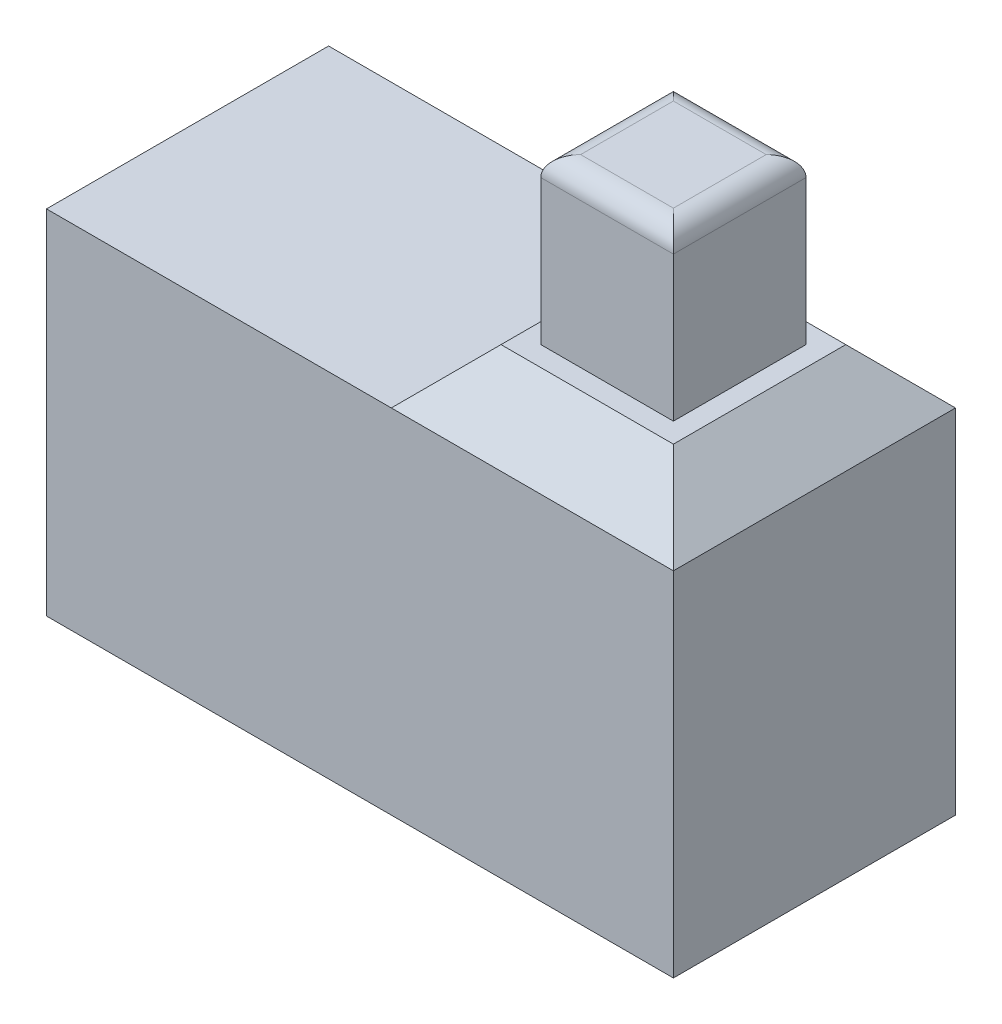
ISO-10303-21;
HEADER;
FILE_DESCRIPTION(('STEP AP214'),'2;1');
FILE_NAME('part.step','',(''),(''),'','','');
FILE_SCHEMA(('AUTOMOTIVE_DESIGN { 1 0 10303 214 1 1 1 1 }'));
ENDSEC;
DATA;
#1=APPLICATION_CONTEXT('core data for automotive mechanical design processes');
#2=APPLICATION_PROTOCOL_DEFINITION('international standard','automotive_design',2000,#1);
#3=PRODUCT_CONTEXT('',#1,'mechanical');
#4=PRODUCT('Part','Part','',(#3));
#5=PRODUCT_RELATED_PRODUCT_CATEGORY('part','',(#4));
#6=PRODUCT_DEFINITION_FORMATION('','',#4);
#7=PRODUCT_DEFINITION_CONTEXT('part definition',#1,'design');
#8=PRODUCT_DEFINITION('design','',#6,#7);
#9=PRODUCT_DEFINITION_SHAPE('','',#8);
#10=(LENGTH_UNIT() NAMED_UNIT(*) SI_UNIT(.MILLI.,.METRE.));
#11=(NAMED_UNIT(*) PLANE_ANGLE_UNIT() SI_UNIT($,.RADIAN.));
#12=(NAMED_UNIT(*) SI_UNIT($,.STERADIAN.) SOLID_ANGLE_UNIT());
#13=UNCERTAINTY_MEASURE_WITH_UNIT(LENGTH_MEASURE(1.E-05),#10,'distance_accuracy_value','');
#14=(GEOMETRIC_REPRESENTATION_CONTEXT(3) GLOBAL_UNCERTAINTY_ASSIGNED_CONTEXT((#13)) GLOBAL_UNIT_ASSIGNED_CONTEXT((#10,
#11,#12)) REPRESENTATION_CONTEXT('',''));
#15=CARTESIAN_POINT('',(0.,0.,0.));
#16=DIRECTION('',(0.,0.,1.));
#17=DIRECTION('',(1.,0.,0.));
#18=AXIS2_PLACEMENT_3D('',#15,#16,#17);
#19=CARTESIAN_POINT('',(0.,5.19999999999998,0.));
#20=DIRECTION('',(0.,-1.,0.));
#21=DIRECTION('',(0.,0.,-1.));
#22=AXIS2_PLACEMENT_3D('',#19,#20,#21);
#23=PLANE('',#22);
#24=DIRECTION('',(0.,0.,1.));
#25=VECTOR('',#24,1.);
#26=CARTESIAN_POINT('',(3.29999999999997,5.19999999999998,-1.11022302462516E-13));
#27=LINE('',#26,#25);
#28=CARTESIAN_POINT('',(3.3,5.19999999999998,1.09999999999999));
#29=VERTEX_POINT('',#28);
#30=CARTESIAN_POINT('',(3.3,5.19999999999998,-1.10000000000002));
#31=VERTEX_POINT('',#30);
#32=EDGE_CURVE('E179',#29,#31,#27,.F.);
#33=ORIENTED_EDGE('',*,*,#32,.T.);
#34=DIRECTION('',(1.,0.,0.));
#35=VECTOR('',#34,1.);
#36=CARTESIAN_POINT('',(0.,5.19999999999998,-1.10000000000002));
#37=LINE('',#36,#35);
#38=CARTESIAN_POINT('',(1.09999999999999,5.19999999999998,-1.09999999999999));
#39=VERTEX_POINT('',#38);
#40=EDGE_CURVE('E413',#31,#39,#37,.F.);
#41=ORIENTED_EDGE('',*,*,#40,.T.);
#42=DIRECTION('',(0.,0.,-1.));
#43=VECTOR('',#42,1.);
#44=CARTESIAN_POINT('',(1.09999999999999,5.19999999999998,0.));
#45=LINE('',#44,#43);
#46=CARTESIAN_POINT('',(1.09999999999999,5.19999999999998,1.09999999999999));
#47=VERTEX_POINT('',#46);
#48=EDGE_CURVE('E419',#39,#47,#45,.F.);
#49=ORIENTED_EDGE('',*,*,#48,.T.);
#50=DIRECTION('',(-1.,0.,0.));
#51=VECTOR('',#50,1.);
#52=CARTESIAN_POINT('',(0.,5.19999999999998,1.09999999999999));
#53=LINE('',#52,#51);
#54=EDGE_CURVE('E418',#47,#29,#53,.F.);
#55=ORIENTED_EDGE('',*,*,#54,.T.);
#56=EDGE_LOOP('',(#33,#41,#49,#55));
#57=FACE_BOUND('',#56,.T.);
#58=DIRECTION('',(1.,0.,0.));
#59=VECTOR('',#58,1.);
#60=CARTESIAN_POINT('',(1.35399999999999,5.19999999999998,0.845999999999986));
#61=LINE('',#60,#59);
#62=CARTESIAN_POINT('',(1.35399999999999,5.19999999999998,0.845999999999986));
#63=VERTEX_POINT('',#62);
#64=CARTESIAN_POINT('',(3.04599999999999,5.19999999999998,0.845999999999902));
#65=VERTEX_POINT('',#64);
#66=EDGE_CURVE('E130',#63,#65,#61,.T.);
#67=ORIENTED_EDGE('',*,*,#66,.F.);
#68=DIRECTION('',(0.,0.,1.));
#69=VECTOR('',#68,1.);
#70=CARTESIAN_POINT('',(1.35399999999999,5.19999999999998,-0.845999999999986));
#71=LINE('',#70,#69);
#72=CARTESIAN_POINT('',(1.35399999999999,5.19999999999998,-0.845999999999986));
#73=VERTEX_POINT('',#72);
#74=EDGE_CURVE('E135',#73,#63,#71,.T.);
#75=ORIENTED_EDGE('',*,*,#74,.F.);
#76=DIRECTION('',(-1.,0.,0.));
#77=VECTOR('',#76,1.);
#78=CARTESIAN_POINT('',(3.04599999999999,5.19999999999998,-0.845999999999986));
#79=LINE('',#78,#77);
#80=CARTESIAN_POINT('',(3.04599999999999,5.19999999999998,-0.845999999999986));
#81=VERTEX_POINT('',#80);
#82=EDGE_CURVE('E147',#81,#73,#79,.T.);
#83=ORIENTED_EDGE('',*,*,#82,.F.);
#84=DIRECTION('',(0.,0.,-1.));
#85=VECTOR('',#84,1.);
#86=CARTESIAN_POINT('',(3.04599999999999,5.19999999999998,0.845999999999902));
#87=LINE('',#86,#85);
#88=EDGE_CURVE('E143',#65,#81,#87,.T.);
#89=ORIENTED_EDGE('',*,*,#88,.F.);
#90=EDGE_LOOP('',(#67,#75,#83,#89));
#91=FACE_BOUND('',#90,.T.);
#92=ADVANCED_FACE('F34',(#57,#91),#23,.F.);
#93=CARTESIAN_POINT('',(-3.99999999999992,4.5,1.80000000000002));
#94=DIRECTION('',(1.,0.,0.));
#95=DIRECTION('',(0.,0.,-1.));
#96=AXIS2_PLACEMENT_3D('',#93,#94,#95);
#97=PLANE('',#96);
#98=DIRECTION('',(0.,0.,1.));
#99=VECTOR('',#98,1.);
#100=CARTESIAN_POINT('',(-3.99999999999992,0.,1.80000000000002));
#101=LINE('',#100,#99);
#102=CARTESIAN_POINT('',(-4.,0.,-1.8));
#103=VERTEX_POINT('',#102);
#104=CARTESIAN_POINT('',(-3.99999999999992,0.,1.80000000000002));
#105=VERTEX_POINT('',#104);
#106=EDGE_CURVE('E380',#103,#105,#101,.T.);
#107=ORIENTED_EDGE('',*,*,#106,.T.);
#108=DIRECTION('',(0.,-1.,0.));
#109=VECTOR('',#108,1.);
#110=CARTESIAN_POINT('',(-3.99999999999992,4.5,1.80000000000002));
#111=LINE('',#110,#109);
#112=CARTESIAN_POINT('',(-3.99999999999992,4.5,1.80000000000002));
#113=VERTEX_POINT('',#112);
#114=EDGE_CURVE('E189',#113,#105,#111,.T.);
#115=ORIENTED_EDGE('',*,*,#114,.F.);
#116=DIRECTION('',(0.,0.,1.));
#117=VECTOR('',#116,1.);
#118=CARTESIAN_POINT('',(-3.99999999999992,4.5,1.80000000000002));
#119=LINE('',#118,#117);
#120=CARTESIAN_POINT('',(-4.,4.5,-1.8));
#121=VERTEX_POINT('',#120);
#122=EDGE_CURVE('E390',#121,#113,#119,.T.);
#123=ORIENTED_EDGE('',*,*,#122,.F.);
#124=DIRECTION('',(0.,-1.,0.));
#125=VECTOR('',#124,1.);
#126=CARTESIAN_POINT('',(-4.,4.5,-1.8));
#127=LINE('',#126,#125);
#128=EDGE_CURVE('E394',#121,#103,#127,.T.);
#129=ORIENTED_EDGE('',*,*,#128,.T.);
#130=EDGE_LOOP('',(#107,#115,#123,#129));
#131=FACE_BOUND('',#130,.T.);
#132=ADVANCED_FACE('F236',(#131),#97,.F.);
#133=CARTESIAN_POINT('',(4.,4.5,1.8));
#134=DIRECTION('',(0.,0.,-1.));
#135=DIRECTION('',(-1.,0.,0.));
#136=AXIS2_PLACEMENT_3D('',#133,#134,#135);
#137=PLANE('',#136);
#138=DIRECTION('',(1.,0.,0.));
#139=VECTOR('',#138,1.);
#140=CARTESIAN_POINT('',(4.,0.,1.8));
#141=LINE('',#140,#139);
#142=CARTESIAN_POINT('',(4.,0.,1.8));
#143=VERTEX_POINT('',#142);
#144=EDGE_CURVE('E370',#105,#143,#141,.T.);
#145=ORIENTED_EDGE('',*,*,#144,.T.);
#146=DIRECTION('',(0.,-1.,0.));
#147=VECTOR('',#146,1.);
#148=CARTESIAN_POINT('',(4.,4.5,1.8));
#149=LINE('',#148,#147);
#150=CARTESIAN_POINT('',(4.,4.5,1.8));
#151=VERTEX_POINT('',#150);
#152=EDGE_CURVE('E373',#151,#143,#149,.T.);
#153=ORIENTED_EDGE('',*,*,#152,.F.);
#154=DIRECTION('',(1.,0.,0.));
#155=VECTOR('',#154,1.);
#156=CARTESIAN_POINT('',(4.,4.5,1.8));
#157=LINE('',#156,#155);
#158=CARTESIAN_POINT('',(0.400000000000095,4.5,1.8));
#159=VERTEX_POINT('',#158);
#160=EDGE_CURVE('E166',#159,#151,#157,.T.);
#161=ORIENTED_EDGE('',*,*,#160,.F.);
#162=DIRECTION('',(1.,0.,0.));
#163=VECTOR('',#162,1.);
#164=CARTESIAN_POINT('',(4.,4.5,1.8));
#165=LINE('',#164,#163);
#166=EDGE_CURVE('E399',#113,#159,#165,.T.);
#167=ORIENTED_EDGE('',*,*,#166,.F.);
#168=ORIENTED_EDGE('',*,*,#114,.T.);
#169=EDGE_LOOP('',(#145,#153,#161,#167,#168));
#170=FACE_BOUND('',#169,.T.);
#171=ADVANCED_FACE('F242',(#170),#137,.F.);
#172=CARTESIAN_POINT('',(4.,4.5,1.8));
#173=DIRECTION('',(-1.,0.,0.));
#174=DIRECTION('',(0.,0.,1.));
#175=AXIS2_PLACEMENT_3D('',#172,#173,#174);
#176=PLANE('',#175);
#177=DIRECTION('',(0.,0.,-1.));
#178=VECTOR('',#177,1.);
#179=CARTESIAN_POINT('',(4.,0.,1.8));
#180=LINE('',#179,#178);
#181=CARTESIAN_POINT('',(3.99999999999989,0.,-1.8));
#182=VERTEX_POINT('',#181);
#183=EDGE_CURVE('E379',#143,#182,#180,.T.);
#184=ORIENTED_EDGE('',*,*,#183,.T.);
#185=DIRECTION('',(0.,-1.,0.));
#186=VECTOR('',#185,1.);
#187=CARTESIAN_POINT('',(3.99999999999989,4.5,-1.8));
#188=LINE('',#187,#186);
#189=CARTESIAN_POINT('',(3.99999999999989,4.5,-1.8));
#190=VERTEX_POINT('',#189);
#191=EDGE_CURVE('E385',#190,#182,#188,.T.);
#192=ORIENTED_EDGE('',*,*,#191,.F.);
#193=DIRECTION('',(0.,0.,-1.));
#194=VECTOR('',#193,1.);
#195=CARTESIAN_POINT('',(4.,4.5,1.8));
#196=LINE('',#195,#194);
#197=EDGE_CURVE('E384',#151,#190,#196,.T.);
#198=ORIENTED_EDGE('',*,*,#197,.F.);
#199=ORIENTED_EDGE('',*,*,#152,.T.);
#200=EDGE_LOOP('',(#184,#192,#198,#199));
#201=FACE_BOUND('',#200,.T.);
#202=ADVANCED_FACE('F276',(#201),#176,.F.);
#203=CARTESIAN_POINT('',(3.99999999999989,4.5,-1.8));
#204=DIRECTION('',(0.,0.,1.));
#205=DIRECTION('',(1.,0.,0.));
#206=AXIS2_PLACEMENT_3D('',#203,#204,#205);
#207=PLANE('',#206);
#208=DIRECTION('',(-1.,0.,0.));
#209=VECTOR('',#208,1.);
#210=CARTESIAN_POINT('',(3.99999999999989,0.,-1.8));
#211=LINE('',#210,#209);
#212=EDGE_CURVE('E388',#182,#103,#211,.T.);
#213=ORIENTED_EDGE('',*,*,#212,.T.);
#214=ORIENTED_EDGE('',*,*,#128,.F.);
#215=DIRECTION('',(-1.,0.,0.));
#216=VECTOR('',#215,1.);
#217=CARTESIAN_POINT('',(3.99999999999989,4.5,-1.8));
#218=LINE('',#217,#216);
#219=CARTESIAN_POINT('',(0.399999999999984,4.5,-1.80000000000011));
#220=VERTEX_POINT('',#219);
#221=EDGE_CURVE('E401',#220,#121,#218,.T.);
#222=ORIENTED_EDGE('',*,*,#221,.F.);
#223=EDGE_CURVE('E167',#190,#220,#218,.T.);
#224=ORIENTED_EDGE('',*,*,#223,.F.);
#225=ORIENTED_EDGE('',*,*,#191,.T.);
#226=EDGE_LOOP('',(#213,#214,#222,#224,#225));
#227=FACE_BOUND('',#226,.T.);
#228=ADVANCED_FACE('F269',(#227),#207,.F.);
#229=CARTESIAN_POINT('',(0.,4.5,0.));
#230=DIRECTION('',(0.,1.,0.));
#231=DIRECTION('',(0.,0.,1.));
#232=AXIS2_PLACEMENT_3D('',#229,#230,#231);
#233=PLANE('',#232);
#234=DIRECTION('',(0.,0.,1.));
#235=VECTOR('',#234,1.);
#236=CARTESIAN_POINT('',(0.399999999999984,4.5,-1.80000000000011));
#237=LINE('',#236,#235);
#238=EDGE_CURVE('E157',#220,#159,#237,.T.);
#239=ORIENTED_EDGE('',*,*,#238,.F.);
#240=ORIENTED_EDGE('',*,*,#221,.T.);
#241=ORIENTED_EDGE('',*,*,#122,.T.);
#242=ORIENTED_EDGE('',*,*,#166,.T.);
#243=EDGE_LOOP('',(#239,#240,#241,#242));
#244=FACE_BOUND('',#243,.T.);
#245=ADVANCED_FACE('F266',(#244),#233,.T.);
#246=CARTESIAN_POINT('',(0.,0.,0.));
#247=DIRECTION('',(0.,1.,0.));
#248=DIRECTION('',(0.,0.,1.));
#249=AXIS2_PLACEMENT_3D('',#246,#247,#248);
#250=PLANE('',#249);
#251=ORIENTED_EDGE('',*,*,#106,.F.);
#252=ORIENTED_EDGE('',*,*,#212,.F.);
#253=ORIENTED_EDGE('',*,*,#183,.F.);
#254=ORIENTED_EDGE('',*,*,#144,.F.);
#255=EDGE_LOOP('',(#251,#252,#253,#254));
#256=FACE_BOUND('',#255,.T.);
#257=ADVANCED_FACE('F253',(#256),#250,.F.);
#258=CARTESIAN_POINT('',(3.99999999999989,4.5,-1.8));
#259=DIRECTION('',(0.707106781186546,0.707106781186549,0.));
#260=DIRECTION('',(-0.707106781186549,0.707106781186546,0.));
#261=AXIS2_PLACEMENT_3D('',#258,#259,#260);
#262=PLANE('',#261);
#263=ORIENTED_EDGE('',*,*,#197,.T.);
#264=DIRECTION('',(0.577350269189627,-0.577350269189624,-0.577350269189627));
#265=VECTOR('',#264,1.);
#266=CARTESIAN_POINT('',(3.99999999999989,4.5,-1.8));
#267=LINE('',#266,#265);
#268=EDGE_CURVE('E160',#31,#190,#267,.T.);
#269=ORIENTED_EDGE('',*,*,#268,.F.);
#270=ORIENTED_EDGE('',*,*,#32,.F.);
#271=DIRECTION('',(0.577350269189626,-0.577350269189624,0.577350269189626));
#272=VECTOR('',#271,1.);
#273=CARTESIAN_POINT('',(2.79999999999989,5.69999999999998,0.600000000000017));
#274=LINE('',#273,#272);
#275=EDGE_CURVE('E174',#29,#151,#274,.T.);
#276=ORIENTED_EDGE('',*,*,#275,.T.);
#277=EDGE_LOOP('',(#263,#269,#270,#276));
#278=FACE_BOUND('',#277,.T.);
#279=ADVANCED_FACE('F249',(#278),#262,.T.);
#280=CARTESIAN_POINT('',(3.99999999999989,4.5,-1.8));
#281=DIRECTION('',(0.,0.707106781186549,-0.707106781186546));
#282=DIRECTION('',(0.,0.707106781186546,0.707106781186549));
#283=AXIS2_PLACEMENT_3D('',#280,#281,#282);
#284=PLANE('',#283);
#285=ORIENTED_EDGE('',*,*,#223,.T.);
#286=DIRECTION('',(-0.577350269189627,-0.577350269189624,-0.577350269189626));
#287=VECTOR('',#286,1.);
#288=CARTESIAN_POINT('',(0.399999999999984,4.5,-1.80000000000011));
#289=LINE('',#288,#287);
#290=EDGE_CURVE('E173',#39,#220,#289,.T.);
#291=ORIENTED_EDGE('',*,*,#290,.F.);
#292=ORIENTED_EDGE('',*,*,#40,.F.);
#293=ORIENTED_EDGE('',*,*,#268,.T.);
#294=EDGE_LOOP('',(#285,#291,#292,#293));
#295=FACE_BOUND('',#294,.T.);
#296=ADVANCED_FACE('F252',(#295),#284,.T.);
#297=CARTESIAN_POINT('',(0.399999999999984,4.5,-1.80000000000011));
#298=DIRECTION('',(-0.707106781186546,0.707106781186549,0.));
#299=DIRECTION('',(-0.707106781186549,-0.707106781186546,0.));
#300=AXIS2_PLACEMENT_3D('',#297,#298,#299);
#301=PLANE('',#300);
#302=ORIENTED_EDGE('',*,*,#238,.T.);
#303=DIRECTION('',(-0.577350269189626,-0.577350269189625,0.577350269189627));
#304=VECTOR('',#303,1.);
#305=CARTESIAN_POINT('',(1.6000000000001,5.69999999999998,0.600000000000017));
#306=LINE('',#305,#304);
#307=EDGE_CURVE('E170',#47,#159,#306,.T.);
#308=ORIENTED_EDGE('',*,*,#307,.F.);
#309=ORIENTED_EDGE('',*,*,#48,.F.);
#310=ORIENTED_EDGE('',*,*,#290,.T.);
#311=EDGE_LOOP('',(#302,#308,#309,#310));
#312=FACE_BOUND('',#311,.T.);
#313=ADVANCED_FACE('F258',(#312),#301,.T.);
#314=CARTESIAN_POINT('',(4.,4.5,1.8));
#315=DIRECTION('',(0.,0.707106781186549,0.707106781186546));
#316=DIRECTION('',(0.,-0.707106781186546,0.707106781186549));
#317=AXIS2_PLACEMENT_3D('',#314,#315,#316);
#318=PLANE('',#317);
#319=ORIENTED_EDGE('',*,*,#160,.T.);
#320=ORIENTED_EDGE('',*,*,#275,.F.);
#321=ORIENTED_EDGE('',*,*,#54,.F.);
#322=ORIENTED_EDGE('',*,*,#307,.T.);
#323=EDGE_LOOP('',(#319,#320,#321,#322));
#324=FACE_BOUND('',#323,.T.);
#325=ADVANCED_FACE('F255',(#324),#318,.T.);
#326=CARTESIAN_POINT('',(1.35399999999999,7.29999999999997,0.845999999999986));
#327=DIRECTION('',(0.,0.,-1.));
#328=DIRECTION('',(-1.,0.,0.));
#329=AXIS2_PLACEMENT_3D('',#326,#327,#328);
#330=PLANE('',#329);
#331=DIRECTION('',(0.,-1.,0.));
#332=VECTOR('',#331,1.);
#333=CARTESIAN_POINT('',(3.04599999999999,7.29999999999997,0.845999999999902));
#334=LINE('',#333,#332);
#335=CARTESIAN_POINT('',(3.04599999999999,7.046,0.845999999999902));
#336=VERTEX_POINT('',#335);
#337=EDGE_CURVE('E155',#336,#65,#334,.T.);
#338=ORIENTED_EDGE('',*,*,#337,.F.);
#339=DIRECTION('',(1.,0.,0.));
#340=VECTOR('',#339,1.);
#341=CARTESIAN_POINT('',(1.35399999999999,7.046,0.845999999999986));
#342=LINE('',#341,#340);
#343=CARTESIAN_POINT('',(1.35399999999999,7.046,0.845999999999986));
#344=VERTEX_POINT('',#343);
#345=EDGE_CURVE('E43',#336,#344,#342,.F.);
#346=ORIENTED_EDGE('',*,*,#345,.T.);
#347=DIRECTION('',(0.,-1.,0.));
#348=VECTOR('',#347,1.);
#349=CARTESIAN_POINT('',(1.35399999999999,7.29999999999997,0.845999999999986));
#350=LINE('',#349,#348);
#351=EDGE_CURVE('E127',#344,#63,#350,.T.);
#352=ORIENTED_EDGE('',*,*,#351,.T.);
#353=ORIENTED_EDGE('',*,*,#66,.T.);
#354=EDGE_LOOP('',(#338,#346,#352,#353));
#355=FACE_BOUND('',#354,.T.);
#356=ADVANCED_FACE('F129',(#355),#330,.F.);
#357=CARTESIAN_POINT('',(3.04599999999999,7.29999999999997,0.845999999999902));
#358=DIRECTION('',(-1.,0.,0.));
#359=DIRECTION('',(0.,0.,1.));
#360=AXIS2_PLACEMENT_3D('',#357,#358,#359);
#361=PLANE('',#360);
#362=DIRECTION('',(0.,-1.,0.));
#363=VECTOR('',#362,1.);
#364=CARTESIAN_POINT('',(3.04599999999999,7.29999999999997,-0.845999999999986));
#365=LINE('',#364,#363);
#366=CARTESIAN_POINT('',(3.04599999999999,7.046,-0.845999999999986));
#367=VERTEX_POINT('',#366);
#368=EDGE_CURVE('E153',#367,#81,#365,.T.);
#369=ORIENTED_EDGE('',*,*,#368,.F.);
#370=DIRECTION('',(0.,0.,-1.));
#371=VECTOR('',#370,1.);
#372=CARTESIAN_POINT('',(3.04599999999999,7.046,0.845999999999902));
#373=LINE('',#372,#371);
#374=EDGE_CURVE('E11',#367,#336,#373,.F.);
#375=ORIENTED_EDGE('',*,*,#374,.T.);
#376=ORIENTED_EDGE('',*,*,#337,.T.);
#377=ORIENTED_EDGE('',*,*,#88,.T.);
#378=EDGE_LOOP('',(#369,#375,#376,#377));
#379=FACE_BOUND('',#378,.T.);
#380=ADVANCED_FACE('F315',(#379),#361,.F.);
#381=CARTESIAN_POINT('',(3.04599999999999,7.29999999999997,-0.845999999999986));
#382=DIRECTION('',(0.,0.,1.));
#383=DIRECTION('',(1.,0.,0.));
#384=AXIS2_PLACEMENT_3D('',#381,#382,#383);
#385=PLANE('',#384);
#386=DIRECTION('',(0.,-1.,0.));
#387=VECTOR('',#386,1.);
#388=CARTESIAN_POINT('',(1.35399999999999,7.29999999999997,-0.845999999999986));
#389=LINE('',#388,#387);
#390=CARTESIAN_POINT('',(1.35399999999999,7.046,-0.845999999999986));
#391=VERTEX_POINT('',#390);
#392=EDGE_CURVE('E134',#391,#73,#389,.T.);
#393=ORIENTED_EDGE('',*,*,#392,.F.);
#394=DIRECTION('',(-1.,0.,0.));
#395=VECTOR('',#394,1.);
#396=CARTESIAN_POINT('',(3.04599999999999,7.046,-0.845999999999986));
#397=LINE('',#396,#395);
#398=EDGE_CURVE('E196',#391,#367,#397,.F.);
#399=ORIENTED_EDGE('',*,*,#398,.T.);
#400=ORIENTED_EDGE('',*,*,#368,.T.);
#401=ORIENTED_EDGE('',*,*,#82,.T.);
#402=EDGE_LOOP('',(#393,#399,#400,#401));
#403=FACE_BOUND('',#402,.T.);
#404=ADVANCED_FACE('F222',(#403),#385,.F.);
#405=CARTESIAN_POINT('',(1.35399999999999,7.29999999999997,-0.845999999999986));
#406=DIRECTION('',(1.,0.,0.));
#407=DIRECTION('',(0.,0.,-1.));
#408=AXIS2_PLACEMENT_3D('',#405,#406,#407);
#409=PLANE('',#408);
#410=ORIENTED_EDGE('',*,*,#351,.F.);
#411=DIRECTION('',(0.,0.,1.));
#412=VECTOR('',#411,1.);
#413=CARTESIAN_POINT('',(1.35399999999999,7.046,-0.845999999999986));
#414=LINE('',#413,#412);
#415=EDGE_CURVE('E199',#344,#391,#414,.F.);
#416=ORIENTED_EDGE('',*,*,#415,.T.);
#417=ORIENTED_EDGE('',*,*,#392,.T.);
#418=ORIENTED_EDGE('',*,*,#74,.T.);
#419=EDGE_LOOP('',(#410,#416,#417,#418));
#420=FACE_BOUND('',#419,.T.);
#421=ADVANCED_FACE('F145',(#420),#409,.F.);
#422=CARTESIAN_POINT('',(0.,7.29999999999997,0.));
#423=DIRECTION('',(0.,1.,0.));
#424=DIRECTION('',(0.,0.,1.));
#425=AXIS2_PLACEMENT_3D('',#422,#423,#424);
#426=PLANE('',#425);
#427=DIRECTION('',(0.,0.,-1.));
#428=VECTOR('',#427,1.);
#429=CARTESIAN_POINT('',(2.79199999999999,7.29999999999997,-0.846000000000097));
#430=LINE('',#429,#428);
#431=CARTESIAN_POINT('',(2.79199999999999,7.29999999999997,0.591999999999898));
#432=VERTEX_POINT('',#431);
#433=CARTESIAN_POINT('',(2.79199999999999,7.29999999999997,-0.592000000000092));
#434=VERTEX_POINT('',#433);
#435=EDGE_CURVE('E186',#432,#434,#430,.T.);
#436=ORIENTED_EDGE('',*,*,#435,.T.);
#437=DIRECTION('',(-1.,0.,0.));
#438=VECTOR('',#437,1.);
#439=CARTESIAN_POINT('',(1.35399999999999,7.29999999999997,-0.592000000000009));
#440=LINE('',#439,#438);
#441=CARTESIAN_POINT('',(1.608,7.29999999999997,-0.592000000000092));
#442=VERTEX_POINT('',#441);
#443=EDGE_CURVE('E193',#434,#442,#440,.T.);
#444=ORIENTED_EDGE('',*,*,#443,.T.);
#445=DIRECTION('',(0.,0.,1.));
#446=VECTOR('',#445,1.);
#447=CARTESIAN_POINT('',(1.608,7.29999999999997,0.845999999999902));
#448=LINE('',#447,#446);
#449=CARTESIAN_POINT('',(1.608,7.29999999999997,0.591999999999898));
#450=VERTEX_POINT('',#449);
#451=EDGE_CURVE('E191',#442,#450,#448,.T.);
#452=ORIENTED_EDGE('',*,*,#451,.T.);
#453=DIRECTION('',(1.,0.,0.));
#454=VECTOR('',#453,1.);
#455=CARTESIAN_POINT('',(3.04599999999999,7.29999999999997,0.591999999999981));
#456=LINE('',#455,#454);
#457=EDGE_CURVE('E188',#450,#432,#456,.T.);
#458=ORIENTED_EDGE('',*,*,#457,.T.);
#459=EDGE_LOOP('',(#436,#444,#452,#458));
#460=FACE_BOUND('',#459,.T.);
#461=ADVANCED_FACE('F227',(#460),#426,.T.);
#462=CARTESIAN_POINT('',(1.11022302462516E-13,7.046,0.591999999999898));
#463=DIRECTION('',(-1.,0.,0.));
#464=DIRECTION('',(0.,0.,1.));
#465=AXIS2_PLACEMENT_3D('',#462,#463,#464);
#466=CYLINDRICAL_SURFACE('',#465,0.254);
#467=CARTESIAN_POINT('',(1.608,7.046,0.591999999999898));
#468=DIRECTION('',(-0.707106781186548,0.,-0.707106781186547));
#469=DIRECTION('',(-0.707106781186547,0.,0.707106781186548));
#470=AXIS2_PLACEMENT_3D('',#467,#468,#469);
#471=ELLIPSE('',#470,0.359210244842766,0.254);
#472=EDGE_CURVE('E205',#344,#450,#471,.T.);
#473=ORIENTED_EDGE('',*,*,#472,.F.);
#474=ORIENTED_EDGE('',*,*,#345,.F.);
#475=CARTESIAN_POINT('',(2.79199999999999,7.046,0.591999999999898));
#476=DIRECTION('',(-0.707106781186547,0.,0.707106781186548));
#477=DIRECTION('',(0.707106781186548,0.,0.707106781186547));
#478=AXIS2_PLACEMENT_3D('',#475,#476,#477);
#479=ELLIPSE('',#478,0.359210244842766,0.254);
#480=EDGE_CURVE('E38',#432,#336,#479,.F.);
#481=ORIENTED_EDGE('',*,*,#480,.F.);
#482=ORIENTED_EDGE('',*,*,#457,.F.);
#483=EDGE_LOOP('',(#473,#474,#481,#482));
#484=FACE_BOUND('',#483,.T.);
#485=ADVANCED_FACE('F36',(#484),#466,.T.);
#486=CARTESIAN_POINT('',(2.79199999999999,7.046,0.));
#487=DIRECTION('',(0.,0.,1.));
#488=DIRECTION('',(1.,0.,0.));
#489=AXIS2_PLACEMENT_3D('',#486,#487,#488);
#490=CYLINDRICAL_SURFACE('',#489,0.254);
#491=ORIENTED_EDGE('',*,*,#480,.T.);
#492=ORIENTED_EDGE('',*,*,#374,.F.);
#493=CARTESIAN_POINT('',(2.79199999999999,7.046,-0.592000000000092));
#494=DIRECTION('',(0.707106781186547,0.,0.707106781186547));
#495=DIRECTION('',(-0.707106781186547,0.,0.707106781186547));
#496=AXIS2_PLACEMENT_3D('',#493,#494,#495);
#497=ELLIPSE('',#496,0.359210244842766,0.254);
#498=EDGE_CURVE('E204',#434,#367,#497,.F.);
#499=ORIENTED_EDGE('',*,*,#498,.F.);
#500=ORIENTED_EDGE('',*,*,#435,.F.);
#501=EDGE_LOOP('',(#491,#492,#499,#500));
#502=FACE_BOUND('',#501,.T.);
#503=ADVANCED_FACE('F214',(#502),#490,.T.);
#504=CARTESIAN_POINT('',(1.608,7.046,-1.11022302462516E-13));
#505=DIRECTION('',(0.,0.,-1.));
#506=DIRECTION('',(-1.,0.,0.));
#507=AXIS2_PLACEMENT_3D('',#504,#505,#506);
#508=CYLINDRICAL_SURFACE('',#507,0.254);
#509=ORIENTED_EDGE('',*,*,#472,.T.);
#510=ORIENTED_EDGE('',*,*,#451,.F.);
#511=CARTESIAN_POINT('',(1.608,7.046,-0.592000000000092));
#512=DIRECTION('',(0.707106781186547,0.,-0.707106781186548));
#513=DIRECTION('',(-0.707106781186548,0.,-0.707106781186547));
#514=AXIS2_PLACEMENT_3D('',#511,#512,#513);
#515=ELLIPSE('',#514,0.359210244842766,0.254);
#516=EDGE_CURVE('E202',#391,#442,#515,.T.);
#517=ORIENTED_EDGE('',*,*,#516,.F.);
#518=ORIENTED_EDGE('',*,*,#415,.F.);
#519=EDGE_LOOP('',(#509,#510,#517,#518));
#520=FACE_BOUND('',#519,.T.);
#521=ADVANCED_FACE('F219',(#520),#508,.T.);
#522=CARTESIAN_POINT('',(-1.11022302462516E-13,7.046,-0.592000000000009));
#523=DIRECTION('',(1.,0.,0.));
#524=DIRECTION('',(0.,0.,-1.));
#525=AXIS2_PLACEMENT_3D('',#522,#523,#524);
#526=CYLINDRICAL_SURFACE('',#525,0.254);
#527=ORIENTED_EDGE('',*,*,#498,.T.);
#528=ORIENTED_EDGE('',*,*,#398,.F.);
#529=ORIENTED_EDGE('',*,*,#516,.T.);
#530=ORIENTED_EDGE('',*,*,#443,.F.);
#531=EDGE_LOOP('',(#527,#528,#529,#530));
#532=FACE_BOUND('',#531,.T.);
#533=ADVANCED_FACE('F224',(#532),#526,.T.);
#534=CLOSED_SHELL('',(#92,#132,#171,#202,#228,#245,#257,#279,#296,#313,#325,#356,#380,#404,#421,
#461,#485,#503,#521,#533));
#535=MANIFOLD_SOLID_BREP('B2',#534);
#536=ADVANCED_BREP_SHAPE_REPRESENTATION('',(#18,#535),#14);
#537=SHAPE_DEFINITION_REPRESENTATION(#9,#536);
ENDSEC;
END-ISO-10303-21;
